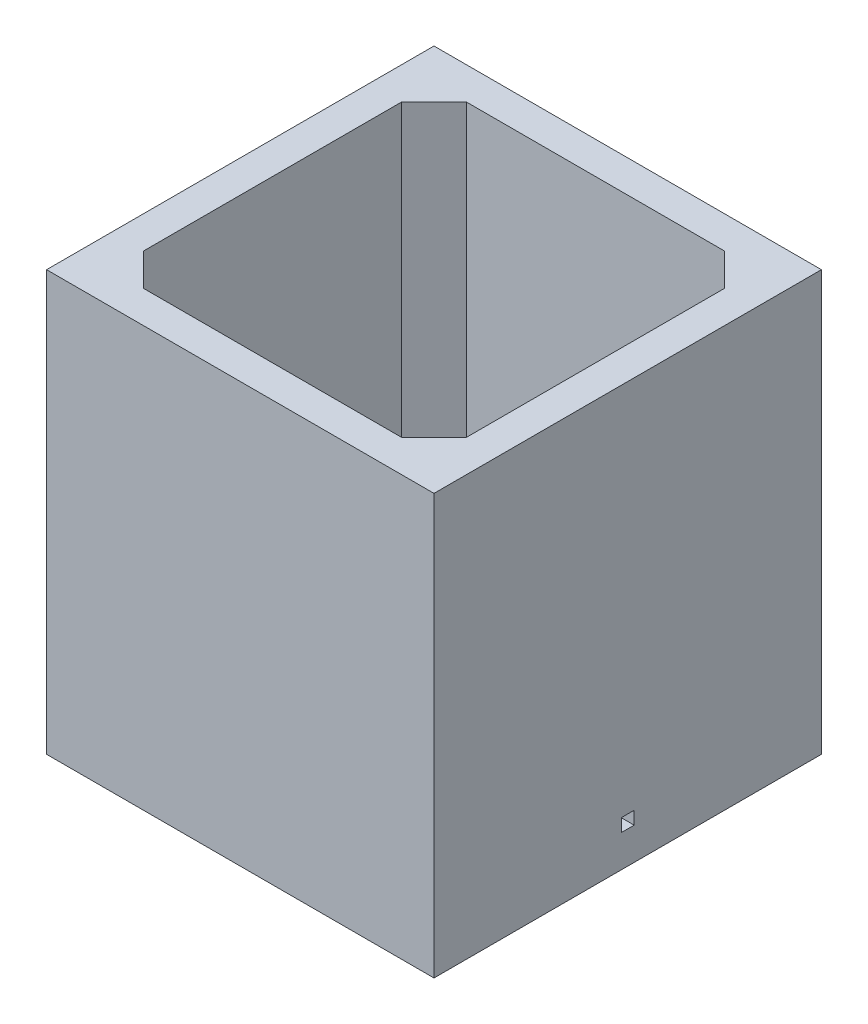
ISO-10303-21;
HEADER;
FILE_DESCRIPTION(('STEP AP214'),'2;1');
FILE_NAME('part.step','',(''),(''),'','','');
FILE_SCHEMA(('AUTOMOTIVE_DESIGN { 1 0 10303 214 1 1 1 1 }'));
ENDSEC;
DATA;
#1=APPLICATION_CONTEXT('core data for automotive mechanical design processes');
#2=APPLICATION_PROTOCOL_DEFINITION('international standard','automotive_design',2000,#1);
#3=PRODUCT_CONTEXT('',#1,'mechanical');
#4=PRODUCT('Part','Part','',(#3));
#5=PRODUCT_RELATED_PRODUCT_CATEGORY('part','',(#4));
#6=PRODUCT_DEFINITION_FORMATION('','',#4);
#7=PRODUCT_DEFINITION_CONTEXT('part definition',#1,'design');
#8=PRODUCT_DEFINITION('design','',#6,#7);
#9=PRODUCT_DEFINITION_SHAPE('','',#8);
#10=(LENGTH_UNIT() NAMED_UNIT(*) SI_UNIT(.MILLI.,.METRE.));
#11=(NAMED_UNIT(*) PLANE_ANGLE_UNIT() SI_UNIT($,.RADIAN.));
#12=(NAMED_UNIT(*) SI_UNIT($,.STERADIAN.) SOLID_ANGLE_UNIT());
#13=UNCERTAINTY_MEASURE_WITH_UNIT(LENGTH_MEASURE(1.E-05),#10,'distance_accuracy_value','');
#14=(GEOMETRIC_REPRESENTATION_CONTEXT(3) GLOBAL_UNCERTAINTY_ASSIGNED_CONTEXT((#13)) GLOBAL_UNIT_ASSIGNED_CONTEXT((#10,
#11,#12)) REPRESENTATION_CONTEXT('',''));
#15=CARTESIAN_POINT('',(0.,0.,0.));
#16=DIRECTION('',(0.,0.,1.));
#17=DIRECTION('',(1.,0.,0.));
#18=AXIS2_PLACEMENT_3D('',#15,#16,#17);
#19=CARTESIAN_POINT('',(0.,60.,0.));
#20=DIRECTION('',(0.,-1.,0.));
#21=DIRECTION('',(0.,0.,-1.));
#22=AXIS2_PLACEMENT_3D('',#19,#20,#21);
#23=PLANE('',#22);
#24=DIRECTION('',(0.,0.,-1.));
#25=VECTOR('',#24,1.);
#26=CARTESIAN_POINT('',(30.,60.,30.));
#27=LINE('',#26,#25);
#28=CARTESIAN_POINT('',(30.,60.,30.));
#29=VERTEX_POINT('',#28);
#30=CARTESIAN_POINT('',(30.,60.,-30.));
#31=VERTEX_POINT('',#30);
#32=EDGE_CURVE('E188',#29,#31,#27,.T.);
#33=ORIENTED_EDGE('',*,*,#32,.T.);
#34=DIRECTION('',(-1.,0.,0.));
#35=VECTOR('',#34,1.);
#36=CARTESIAN_POINT('',(-30.,60.,-30.));
#37=LINE('',#36,#35);
#38=CARTESIAN_POINT('',(-30.,60.,-30.));
#39=VERTEX_POINT('',#38);
#40=EDGE_CURVE('E191',#31,#39,#37,.T.);
#41=ORIENTED_EDGE('',*,*,#40,.T.);
#42=DIRECTION('',(0.,0.,1.));
#43=VECTOR('',#42,1.);
#44=CARTESIAN_POINT('',(-30.,60.,30.));
#45=LINE('',#44,#43);
#46=CARTESIAN_POINT('',(-30.,60.,30.));
#47=VERTEX_POINT('',#46);
#48=EDGE_CURVE('E193',#39,#47,#45,.T.);
#49=ORIENTED_EDGE('',*,*,#48,.T.);
#50=DIRECTION('',(1.,0.,0.));
#51=VECTOR('',#50,1.);
#52=CARTESIAN_POINT('',(-30.,60.,30.));
#53=LINE('',#52,#51);
#54=EDGE_CURVE('E195',#47,#29,#53,.T.);
#55=ORIENTED_EDGE('',*,*,#54,.T.);
#56=EDGE_LOOP('',(#33,#41,#49,#55));
#57=FACE_BOUND('',#56,.T.);
#58=DIRECTION('',(0.,0.,-1.));
#59=VECTOR('',#58,1.);
#60=CARTESIAN_POINT('',(25.,60.,25.));
#61=LINE('',#60,#59);
#62=CARTESIAN_POINT('',(25.,60.,20.));
#63=VERTEX_POINT('',#62);
#64=CARTESIAN_POINT('',(25.,60.,-20.));
#65=VERTEX_POINT('',#64);
#66=EDGE_CURVE('E187',#63,#65,#61,.T.);
#67=ORIENTED_EDGE('',*,*,#66,.F.);
#68=DIRECTION('',(0.707106781186551,0.,-0.707106781186544));
#69=VECTOR('',#68,1.);
#70=CARTESIAN_POINT('',(22.4999999999999,60.,22.5000000000001));
#71=LINE('',#70,#69);
#72=CARTESIAN_POINT('',(20.,60.,25.));
#73=VERTEX_POINT('',#72);
#74=EDGE_CURVE('E232',#63,#73,#71,.F.);
#75=ORIENTED_EDGE('',*,*,#74,.T.);
#76=DIRECTION('',(1.,0.,0.));
#77=VECTOR('',#76,1.);
#78=CARTESIAN_POINT('',(-25.,60.,25.));
#79=LINE('',#78,#77);
#80=CARTESIAN_POINT('',(-20.,60.,25.));
#81=VERTEX_POINT('',#80);
#82=EDGE_CURVE('E180',#81,#73,#79,.T.);
#83=ORIENTED_EDGE('',*,*,#82,.F.);
#84=DIRECTION('',(0.707106781186544,0.,0.707106781186551));
#85=VECTOR('',#84,1.);
#86=CARTESIAN_POINT('',(-22.5000000000001,60.,22.4999999999999));
#87=LINE('',#86,#85);
#88=CARTESIAN_POINT('',(-25.,60.,20.));
#89=VERTEX_POINT('',#88);
#90=EDGE_CURVE('E11',#81,#89,#87,.F.);
#91=ORIENTED_EDGE('',*,*,#90,.T.);
#92=DIRECTION('',(0.,0.,1.));
#93=VECTOR('',#92,1.);
#94=CARTESIAN_POINT('',(-25.,60.,25.));
#95=LINE('',#94,#93);
#96=CARTESIAN_POINT('',(-25.,60.,-20.));
#97=VERTEX_POINT('',#96);
#98=EDGE_CURVE('E244',#97,#89,#95,.T.);
#99=ORIENTED_EDGE('',*,*,#98,.F.);
#100=DIRECTION('',(-0.707106781186551,0.,0.707106781186544));
#101=VECTOR('',#100,1.);
#102=CARTESIAN_POINT('',(-22.4999999999999,60.,-22.5000000000001));
#103=LINE('',#102,#101);
#104=CARTESIAN_POINT('',(-20.,60.,-25.));
#105=VERTEX_POINT('',#104);
#106=EDGE_CURVE('E46',#97,#105,#103,.F.);
#107=ORIENTED_EDGE('',*,*,#106,.T.);
#108=DIRECTION('',(-1.,0.,0.));
#109=VECTOR('',#108,1.);
#110=CARTESIAN_POINT('',(-25.,60.,-25.));
#111=LINE('',#110,#109);
#112=CARTESIAN_POINT('',(20.,60.,-25.));
#113=VERTEX_POINT('',#112);
#114=EDGE_CURVE('E241',#113,#105,#111,.T.);
#115=ORIENTED_EDGE('',*,*,#114,.F.);
#116=DIRECTION('',(-0.707106781186545,0.,-0.70710678118655));
#117=VECTOR('',#116,1.);
#118=CARTESIAN_POINT('',(22.5000000000001,60.,-22.4999999999999));
#119=LINE('',#118,#117);
#120=EDGE_CURVE('E234',#113,#65,#119,.F.);
#121=ORIENTED_EDGE('',*,*,#120,.T.);
#122=EDGE_LOOP('',(#67,#75,#83,#91,#99,#107,#115,#121));
#123=FACE_BOUND('',#122,.T.);
#124=ADVANCED_FACE('F37',(#57,#123),#23,.F.);
#125=CARTESIAN_POINT('',(30.,60.,30.));
#126=DIRECTION('',(-1.,0.,0.));
#127=DIRECTION('',(0.,0.,1.));
#128=AXIS2_PLACEMENT_3D('',#125,#126,#127);
#129=PLANE('',#128);
#130=DIRECTION('',(0.,0.,1.));
#131=VECTOR('',#130,1.);
#132=CARTESIAN_POINT('',(30.,2.,-1.));
#133=LINE('',#132,#131);
#134=CARTESIAN_POINT('',(30.,2.,-1.));
#135=VERTEX_POINT('',#134);
#136=CARTESIAN_POINT('',(30.,2.,1.));
#137=VERTEX_POINT('',#136);
#138=EDGE_CURVE('E301',#135,#137,#133,.T.);
#139=ORIENTED_EDGE('',*,*,#138,.F.);
#140=DIRECTION('',(0.,1.,0.));
#141=VECTOR('',#140,1.);
#142=CARTESIAN_POINT('',(30.,0.,-1.));
#143=LINE('',#142,#141);
#144=CARTESIAN_POINT('',(30.,0.,-1.));
#145=VERTEX_POINT('',#144);
#146=EDGE_CURVE('E293',#145,#135,#143,.T.);
#147=ORIENTED_EDGE('',*,*,#146,.F.);
#148=DIRECTION('',(0.,0.,-1.));
#149=VECTOR('',#148,1.);
#150=CARTESIAN_POINT('',(30.,0.,-1.));
#151=LINE('',#150,#149);
#152=CARTESIAN_POINT('',(30.,0.,0.999999999999997));
#153=VERTEX_POINT('',#152);
#154=EDGE_CURVE('E289',#153,#145,#151,.T.);
#155=ORIENTED_EDGE('',*,*,#154,.F.);
#156=DIRECTION('',(0.,-1.,0.));
#157=VECTOR('',#156,1.);
#158=CARTESIAN_POINT('',(30.,0.,1.));
#159=LINE('',#158,#157);
#160=EDGE_CURVE('E156',#137,#153,#159,.T.);
#161=ORIENTED_EDGE('',*,*,#160,.F.);
#162=EDGE_LOOP('',(#139,#147,#155,#161));
#163=FACE_BOUND('',#162,.T.);
#164=DIRECTION('',(0.,-1.,0.));
#165=VECTOR('',#164,1.);
#166=CARTESIAN_POINT('',(30.,60.,30.));
#167=LINE('',#166,#165);
#168=CARTESIAN_POINT('',(30.,-5.,30.));
#169=VERTEX_POINT('',#168);
#170=EDGE_CURVE('E197',#29,#169,#167,.T.);
#171=ORIENTED_EDGE('',*,*,#170,.T.);
#172=DIRECTION('',(0.,0.,1.));
#173=VECTOR('',#172,1.);
#174=CARTESIAN_POINT('',(30.,-5.,-30.));
#175=LINE('',#174,#173);
#176=CARTESIAN_POINT('',(30.,-5.,-30.));
#177=VERTEX_POINT('',#176);
#178=EDGE_CURVE('E282',#177,#169,#175,.T.);
#179=ORIENTED_EDGE('',*,*,#178,.F.);
#180=DIRECTION('',(0.,-1.,0.));
#181=VECTOR('',#180,1.);
#182=CARTESIAN_POINT('',(30.,60.,-30.));
#183=LINE('',#182,#181);
#184=EDGE_CURVE('E203',#31,#177,#183,.T.);
#185=ORIENTED_EDGE('',*,*,#184,.F.);
#186=ORIENTED_EDGE('',*,*,#32,.F.);
#187=EDGE_LOOP('',(#171,#179,#185,#186));
#188=FACE_BOUND('',#187,.T.);
#189=ADVANCED_FACE('F309',(#163,#188),#129,.F.);
#190=CARTESIAN_POINT('',(-30.,60.,-30.));
#191=DIRECTION('',(0.,0.,1.));
#192=DIRECTION('',(1.,0.,0.));
#193=AXIS2_PLACEMENT_3D('',#190,#191,#192);
#194=PLANE('',#193);
#195=ORIENTED_EDGE('',*,*,#184,.T.);
#196=DIRECTION('',(1.,0.,0.));
#197=VECTOR('',#196,1.);
#198=CARTESIAN_POINT('',(-30.,-5.,-30.));
#199=LINE('',#198,#197);
#200=CARTESIAN_POINT('',(-30.,-5.,-30.));
#201=VERTEX_POINT('',#200);
#202=EDGE_CURVE('E178',#201,#177,#199,.T.);
#203=ORIENTED_EDGE('',*,*,#202,.F.);
#204=DIRECTION('',(0.,-1.,0.));
#205=VECTOR('',#204,1.);
#206=CARTESIAN_POINT('',(-30.,60.,-30.));
#207=LINE('',#206,#205);
#208=EDGE_CURVE('E201',#39,#201,#207,.T.);
#209=ORIENTED_EDGE('',*,*,#208,.F.);
#210=ORIENTED_EDGE('',*,*,#40,.F.);
#211=EDGE_LOOP('',(#195,#203,#209,#210));
#212=FACE_BOUND('',#211,.T.);
#213=ADVANCED_FACE('F331',(#212),#194,.F.);
#214=CARTESIAN_POINT('',(-30.,60.,30.));
#215=DIRECTION('',(1.,0.,0.));
#216=DIRECTION('',(0.,0.,-1.));
#217=AXIS2_PLACEMENT_3D('',#214,#215,#216);
#218=PLANE('',#217);
#219=ORIENTED_EDGE('',*,*,#208,.T.);
#220=DIRECTION('',(0.,0.,-1.));
#221=VECTOR('',#220,1.);
#222=CARTESIAN_POINT('',(-30.,-5.,-30.));
#223=LINE('',#222,#221);
#224=CARTESIAN_POINT('',(-30.,-5.,30.));
#225=VERTEX_POINT('',#224);
#226=EDGE_CURVE('E276',#225,#201,#223,.T.);
#227=ORIENTED_EDGE('',*,*,#226,.F.);
#228=DIRECTION('',(0.,-1.,0.));
#229=VECTOR('',#228,1.);
#230=CARTESIAN_POINT('',(-30.,60.,30.));
#231=LINE('',#230,#229);
#232=EDGE_CURVE('E199',#47,#225,#231,.T.);
#233=ORIENTED_EDGE('',*,*,#232,.F.);
#234=ORIENTED_EDGE('',*,*,#48,.F.);
#235=EDGE_LOOP('',(#219,#227,#233,#234));
#236=FACE_BOUND('',#235,.T.);
#237=ADVANCED_FACE('F339',(#236),#218,.F.);
#238=CARTESIAN_POINT('',(-30.,60.,30.));
#239=DIRECTION('',(0.,0.,-1.));
#240=DIRECTION('',(-1.,0.,0.));
#241=AXIS2_PLACEMENT_3D('',#238,#239,#240);
#242=PLANE('',#241);
#243=ORIENTED_EDGE('',*,*,#232,.T.);
#244=DIRECTION('',(-1.,0.,0.));
#245=VECTOR('',#244,1.);
#246=CARTESIAN_POINT('',(-30.,-5.,30.));
#247=LINE('',#246,#245);
#248=EDGE_CURVE('E279',#169,#225,#247,.T.);
#249=ORIENTED_EDGE('',*,*,#248,.F.);
#250=ORIENTED_EDGE('',*,*,#170,.F.);
#251=ORIENTED_EDGE('',*,*,#54,.F.);
#252=EDGE_LOOP('',(#243,#249,#250,#251));
#253=FACE_BOUND('',#252,.T.);
#254=ADVANCED_FACE('F336',(#253),#242,.F.);
#255=CARTESIAN_POINT('',(25.,60.,25.));
#256=DIRECTION('',(-1.,0.,0.));
#257=DIRECTION('',(0.,0.,1.));
#258=AXIS2_PLACEMENT_3D('',#255,#256,#257);
#259=PLANE('',#258);
#260=DIRECTION('',(0.,-1.,0.));
#261=VECTOR('',#260,1.);
#262=CARTESIAN_POINT('',(25.,0.,-1.));
#263=LINE('',#262,#261);
#264=CARTESIAN_POINT('',(25.,2.,-1.));
#265=VERTEX_POINT('',#264);
#266=CARTESIAN_POINT('',(25.,0.,-1.));
#267=VERTEX_POINT('',#266);
#268=EDGE_CURVE('E61',#265,#267,#263,.T.);
#269=ORIENTED_EDGE('',*,*,#268,.F.);
#270=DIRECTION('',(0.,0.,-1.));
#271=VECTOR('',#270,1.);
#272=CARTESIAN_POINT('',(25.,2.,-1.));
#273=LINE('',#272,#271);
#274=CARTESIAN_POINT('',(25.,2.,1.));
#275=VERTEX_POINT('',#274);
#276=EDGE_CURVE('E167',#275,#265,#273,.T.);
#277=ORIENTED_EDGE('',*,*,#276,.F.);
#278=DIRECTION('',(0.,1.,0.));
#279=VECTOR('',#278,1.);
#280=CARTESIAN_POINT('',(25.,0.,1.));
#281=LINE('',#280,#279);
#282=CARTESIAN_POINT('',(25.,0.,1.));
#283=VERTEX_POINT('',#282);
#284=EDGE_CURVE('E153',#283,#275,#281,.T.);
#285=ORIENTED_EDGE('',*,*,#284,.F.);
#286=DIRECTION('',(0.,0.,-1.));
#287=VECTOR('',#286,1.);
#288=CARTESIAN_POINT('',(25.,0.,25.));
#289=LINE('',#288,#287);
#290=CARTESIAN_POINT('',(25.,0.,20.));
#291=VERTEX_POINT('',#290);
#292=EDGE_CURVE('E164',#291,#283,#289,.T.);
#293=ORIENTED_EDGE('',*,*,#292,.F.);
#294=DIRECTION('',(0.,1.,0.));
#295=VECTOR('',#294,1.);
#296=CARTESIAN_POINT('',(25.,60.,20.));
#297=LINE('',#296,#295);
#298=EDGE_CURVE('E220',#291,#63,#297,.T.);
#299=ORIENTED_EDGE('',*,*,#298,.T.);
#300=ORIENTED_EDGE('',*,*,#66,.T.);
#301=DIRECTION('',(0.,-1.,0.));
#302=VECTOR('',#301,1.);
#303=CARTESIAN_POINT('',(25.,0.,-20.));
#304=LINE('',#303,#302);
#305=CARTESIAN_POINT('',(25.,0.,-20.));
#306=VERTEX_POINT('',#305);
#307=EDGE_CURVE('E217',#65,#306,#304,.T.);
#308=ORIENTED_EDGE('',*,*,#307,.T.);
#309=EDGE_CURVE('E173',#267,#306,#289,.T.);
#310=ORIENTED_EDGE('',*,*,#309,.F.);
#311=EDGE_LOOP('',(#269,#277,#285,#293,#299,#300,#308,#310));
#312=FACE_BOUND('',#311,.T.);
#313=ADVANCED_FACE('F163',(#312),#259,.T.);
#314=CARTESIAN_POINT('',(-25.,60.,-25.));
#315=DIRECTION('',(0.,0.,1.));
#316=DIRECTION('',(1.,0.,0.));
#317=AXIS2_PLACEMENT_3D('',#314,#315,#316);
#318=PLANE('',#317);
#319=DIRECTION('',(-1.,0.,0.));
#320=VECTOR('',#319,1.);
#321=CARTESIAN_POINT('',(-25.,0.,-25.));
#322=LINE('',#321,#320);
#323=CARTESIAN_POINT('',(20.,0.,-25.));
#324=VERTEX_POINT('',#323);
#325=CARTESIAN_POINT('',(-20.,0.,-25.));
#326=VERTEX_POINT('',#325);
#327=EDGE_CURVE('E172',#324,#326,#322,.T.);
#328=ORIENTED_EDGE('',*,*,#327,.F.);
#329=DIRECTION('',(0.,1.,0.));
#330=VECTOR('',#329,1.);
#331=CARTESIAN_POINT('',(20.,60.,-25.));
#332=LINE('',#331,#330);
#333=EDGE_CURVE('E225',#324,#113,#332,.T.);
#334=ORIENTED_EDGE('',*,*,#333,.T.);
#335=ORIENTED_EDGE('',*,*,#114,.T.);
#336=DIRECTION('',(0.,-1.,0.));
#337=VECTOR('',#336,1.);
#338=CARTESIAN_POINT('',(-20.,0.,-25.));
#339=LINE('',#338,#337);
#340=EDGE_CURVE('E222',#105,#326,#339,.T.);
#341=ORIENTED_EDGE('',*,*,#340,.T.);
#342=EDGE_LOOP('',(#328,#334,#335,#341));
#343=FACE_BOUND('',#342,.T.);
#344=ADVANCED_FACE('F250',(#343),#318,.T.);
#345=CARTESIAN_POINT('',(-25.,60.,25.));
#346=DIRECTION('',(1.,0.,0.));
#347=DIRECTION('',(0.,0.,-1.));
#348=AXIS2_PLACEMENT_3D('',#345,#346,#347);
#349=PLANE('',#348);
#350=DIRECTION('',(0.,0.,1.));
#351=VECTOR('',#350,1.);
#352=CARTESIAN_POINT('',(-25.,0.,25.));
#353=LINE('',#352,#351);
#354=CARTESIAN_POINT('',(-25.,0.,-20.));
#355=VERTEX_POINT('',#354);
#356=CARTESIAN_POINT('',(-25.,0.,20.));
#357=VERTEX_POINT('',#356);
#358=EDGE_CURVE('E176',#355,#357,#353,.T.);
#359=ORIENTED_EDGE('',*,*,#358,.F.);
#360=DIRECTION('',(0.,1.,0.));
#361=VECTOR('',#360,1.);
#362=CARTESIAN_POINT('',(-25.,60.,-20.));
#363=LINE('',#362,#361);
#364=EDGE_CURVE('E230',#355,#97,#363,.T.);
#365=ORIENTED_EDGE('',*,*,#364,.T.);
#366=ORIENTED_EDGE('',*,*,#98,.T.);
#367=DIRECTION('',(0.,-1.,0.));
#368=VECTOR('',#367,1.);
#369=CARTESIAN_POINT('',(-25.,0.,20.));
#370=LINE('',#369,#368);
#371=EDGE_CURVE('E227',#89,#357,#370,.T.);
#372=ORIENTED_EDGE('',*,*,#371,.T.);
#373=EDGE_LOOP('',(#359,#365,#366,#372));
#374=FACE_BOUND('',#373,.T.);
#375=ADVANCED_FACE('F256',(#374),#349,.T.);
#376=CARTESIAN_POINT('',(-25.,60.,25.));
#377=DIRECTION('',(0.,0.,-1.));
#378=DIRECTION('',(-1.,0.,0.));
#379=AXIS2_PLACEMENT_3D('',#376,#377,#378);
#380=PLANE('',#379);
#381=ORIENTED_EDGE('',*,*,#82,.T.);
#382=DIRECTION('',(0.,-1.,0.));
#383=VECTOR('',#382,1.);
#384=CARTESIAN_POINT('',(20.,0.,25.));
#385=LINE('',#384,#383);
#386=CARTESIAN_POINT('',(20.,0.,25.));
#387=VERTEX_POINT('',#386);
#388=EDGE_CURVE('E207',#73,#387,#385,.T.);
#389=ORIENTED_EDGE('',*,*,#388,.T.);
#390=DIRECTION('',(1.,0.,0.));
#391=VECTOR('',#390,1.);
#392=CARTESIAN_POINT('',(-25.,0.,25.));
#393=LINE('',#392,#391);
#394=CARTESIAN_POINT('',(-20.,0.,25.));
#395=VERTEX_POINT('',#394);
#396=EDGE_CURVE('E185',#395,#387,#393,.T.);
#397=ORIENTED_EDGE('',*,*,#396,.F.);
#398=DIRECTION('',(0.,1.,0.));
#399=VECTOR('',#398,1.);
#400=CARTESIAN_POINT('',(-20.,60.,25.));
#401=LINE('',#400,#399);
#402=EDGE_CURVE('E205',#395,#81,#401,.T.);
#403=ORIENTED_EDGE('',*,*,#402,.T.);
#404=EDGE_LOOP('',(#381,#389,#397,#403));
#405=FACE_BOUND('',#404,.T.);
#406=ADVANCED_FACE('F264',(#405),#380,.T.);
#407=CARTESIAN_POINT('',(0.,0.,0.));
#408=DIRECTION('',(0.,1.,0.));
#409=DIRECTION('',(0.,0.,1.));
#410=AXIS2_PLACEMENT_3D('',#407,#408,#409);
#411=PLANE('',#410);
#412=CARTESIAN_POINT('',(0.,0.,0.));
#413=DIRECTION('',(0.,1.,0.));
#414=DIRECTION('',(0.,0.,1.));
#415=AXIS2_PLACEMENT_3D('',#412,#413,#414);
#416=CIRCLE('',#415,10.);
#417=CARTESIAN_POINT('',(0.,0.,10.));
#418=VERTEX_POINT('',#417);
#419=EDGE_CURVE('E286',#418,#418,#416,.T.);
#420=ORIENTED_EDGE('',*,*,#419,.F.);
#421=EDGE_LOOP('',(#420));
#422=FACE_BOUND('',#421,.T.);
#423=ORIENTED_EDGE('',*,*,#396,.T.);
#424=DIRECTION('',(-0.707106781186551,0.,0.707106781186544));
#425=VECTOR('',#424,1.);
#426=CARTESIAN_POINT('',(22.4999999999999,0.,22.5000000000001));
#427=LINE('',#426,#425);
#428=EDGE_CURVE('E171',#387,#291,#427,.F.);
#429=ORIENTED_EDGE('',*,*,#428,.T.);
#430=ORIENTED_EDGE('',*,*,#292,.T.);
#431=DIRECTION('',(-1.,0.,0.));
#432=VECTOR('',#431,1.);
#433=CARTESIAN_POINT('',(32.8284271247462,0.,1.));
#434=LINE('',#433,#432);
#435=EDGE_CURVE('E53',#153,#283,#434,.T.);
#436=ORIENTED_EDGE('',*,*,#435,.F.);
#437=ORIENTED_EDGE('',*,*,#154,.T.);
#438=DIRECTION('',(-1.,0.,0.));
#439=VECTOR('',#438,1.);
#440=CARTESIAN_POINT('',(32.8284271247462,0.,-1.));
#441=LINE('',#440,#439);
#442=EDGE_CURVE('E159',#145,#267,#441,.T.);
#443=ORIENTED_EDGE('',*,*,#442,.T.);
#444=ORIENTED_EDGE('',*,*,#309,.T.);
#445=DIRECTION('',(0.707106781186545,0.,0.70710678118655));
#446=VECTOR('',#445,1.);
#447=CARTESIAN_POINT('',(22.5000000000001,0.,-22.4999999999999));
#448=LINE('',#447,#446);
#449=EDGE_CURVE('E214',#306,#324,#448,.F.);
#450=ORIENTED_EDGE('',*,*,#449,.T.);
#451=ORIENTED_EDGE('',*,*,#327,.T.);
#452=DIRECTION('',(0.707106781186551,0.,-0.707106781186544));
#453=VECTOR('',#452,1.);
#454=CARTESIAN_POINT('',(-22.4999999999999,0.,-22.5000000000001));
#455=LINE('',#454,#453);
#456=EDGE_CURVE('E212',#326,#355,#455,.F.);
#457=ORIENTED_EDGE('',*,*,#456,.T.);
#458=ORIENTED_EDGE('',*,*,#358,.T.);
#459=DIRECTION('',(-0.707106781186544,0.,-0.707106781186551));
#460=VECTOR('',#459,1.);
#461=CARTESIAN_POINT('',(-22.5000000000001,0.,22.4999999999999));
#462=LINE('',#461,#460);
#463=EDGE_CURVE('E210',#357,#395,#462,.F.);
#464=ORIENTED_EDGE('',*,*,#463,.T.);
#465=EDGE_LOOP('',(#423,#429,#430,#436,#437,#443,#444,#450,#451,#457,#458,#464));
#466=FACE_BOUND('',#465,.T.);
#467=ADVANCED_FACE('F170',(#422,#466),#411,.T.);
#468=CARTESIAN_POINT('',(0.,-5.,0.));
#469=DIRECTION('',(0.,1.,0.));
#470=DIRECTION('',(0.,0.,1.));
#471=AXIS2_PLACEMENT_3D('',#468,#469,#470);
#472=PLANE('',#471);
#473=CARTESIAN_POINT('',(0.,-5.,0.));
#474=DIRECTION('',(0.,1.,0.));
#475=DIRECTION('',(0.,0.,1.));
#476=AXIS2_PLACEMENT_3D('',#473,#474,#475);
#477=CIRCLE('',#476,10.);
#478=CARTESIAN_POINT('',(0.,-5.,10.));
#479=VERTEX_POINT('',#478);
#480=EDGE_CURVE('E285',#479,#479,#477,.T.);
#481=ORIENTED_EDGE('',*,*,#480,.T.);
#482=EDGE_LOOP('',(#481));
#483=FACE_BOUND('',#482,.T.);
#484=ORIENTED_EDGE('',*,*,#178,.T.);
#485=ORIENTED_EDGE('',*,*,#248,.T.);
#486=ORIENTED_EDGE('',*,*,#226,.T.);
#487=ORIENTED_EDGE('',*,*,#202,.T.);
#488=EDGE_LOOP('',(#484,#485,#486,#487));
#489=FACE_BOUND('',#488,.T.);
#490=ADVANCED_FACE('F364',(#483,#489),#472,.F.);
#491=CARTESIAN_POINT('',(0.,-5.,0.));
#492=DIRECTION('',(0.,1.,0.));
#493=DIRECTION('',(0.,0.,1.));
#494=AXIS2_PLACEMENT_3D('',#491,#492,#493);
#495=CYLINDRICAL_SURFACE('',#494,10.);
#496=ORIENTED_EDGE('',*,*,#480,.F.);
#497=EDGE_LOOP('',(#496));
#498=FACE_BOUND('',#497,.T.);
#499=ORIENTED_EDGE('',*,*,#419,.T.);
#500=EDGE_LOOP('',(#499));
#501=FACE_BOUND('',#500,.T.);
#502=ADVANCED_FACE('F322',(#498,#501),#495,.F.);
#503=CARTESIAN_POINT('',(20.,60.,25.));
#504=DIRECTION('',(-0.707106781186543,0.,-0.707106781186551));
#505=DIRECTION('',(0.,1.,0.));
#506=AXIS2_PLACEMENT_3D('',#503,#504,#505);
#507=PLANE('',#506);
#508=ORIENTED_EDGE('',*,*,#74,.F.);
#509=ORIENTED_EDGE('',*,*,#298,.F.);
#510=ORIENTED_EDGE('',*,*,#428,.F.);
#511=ORIENTED_EDGE('',*,*,#388,.F.);
#512=EDGE_LOOP('',(#508,#509,#510,#511));
#513=FACE_BOUND('',#512,.T.);
#514=ADVANCED_FACE('F269',(#513),#507,.T.);
#515=CARTESIAN_POINT('',(25.,60.,-20.));
#516=DIRECTION('',(-0.707106781186551,0.,0.707106781186545));
#517=DIRECTION('',(0.,1.,0.));
#518=AXIS2_PLACEMENT_3D('',#515,#516,#517);
#519=PLANE('',#518);
#520=ORIENTED_EDGE('',*,*,#120,.F.);
#521=ORIENTED_EDGE('',*,*,#333,.F.);
#522=ORIENTED_EDGE('',*,*,#449,.F.);
#523=ORIENTED_EDGE('',*,*,#307,.F.);
#524=EDGE_LOOP('',(#520,#521,#522,#523));
#525=FACE_BOUND('',#524,.T.);
#526=ADVANCED_FACE('F315',(#525),#519,.T.);
#527=CARTESIAN_POINT('',(-20.,60.,-25.));
#528=DIRECTION('',(0.707106781186543,0.,0.707106781186551));
#529=DIRECTION('',(0.,1.,0.));
#530=AXIS2_PLACEMENT_3D('',#527,#528,#529);
#531=PLANE('',#530);
#532=ORIENTED_EDGE('',*,*,#106,.F.);
#533=ORIENTED_EDGE('',*,*,#364,.F.);
#534=ORIENTED_EDGE('',*,*,#456,.F.);
#535=ORIENTED_EDGE('',*,*,#340,.F.);
#536=EDGE_LOOP('',(#532,#533,#534,#535));
#537=FACE_BOUND('',#536,.T.);
#538=ADVANCED_FACE('F253',(#537),#531,.T.);
#539=CARTESIAN_POINT('',(-25.,60.,20.));
#540=DIRECTION('',(0.707106781186551,0.,-0.707106781186543));
#541=DIRECTION('',(0.,1.,0.));
#542=AXIS2_PLACEMENT_3D('',#539,#540,#541);
#543=PLANE('',#542);
#544=ORIENTED_EDGE('',*,*,#90,.F.);
#545=ORIENTED_EDGE('',*,*,#402,.F.);
#546=ORIENTED_EDGE('',*,*,#463,.F.);
#547=ORIENTED_EDGE('',*,*,#371,.F.);
#548=EDGE_LOOP('',(#544,#545,#546,#547));
#549=FACE_BOUND('',#548,.T.);
#550=ADVANCED_FACE('F40',(#549),#543,.T.);
#551=CARTESIAN_POINT('',(32.8284271247462,0.,-1.));
#552=DIRECTION('',(0.,0.,-1.));
#553=DIRECTION('',(-1.,0.,0.));
#554=AXIS2_PLACEMENT_3D('',#551,#552,#553);
#555=PLANE('',#554);
#556=ORIENTED_EDGE('',*,*,#146,.T.);
#557=DIRECTION('',(-1.,0.,0.));
#558=VECTOR('',#557,1.);
#559=CARTESIAN_POINT('',(32.8284271247462,2.,-1.));
#560=LINE('',#559,#558);
#561=EDGE_CURVE('E296',#135,#265,#560,.T.);
#562=ORIENTED_EDGE('',*,*,#561,.T.);
#563=ORIENTED_EDGE('',*,*,#268,.T.);
#564=ORIENTED_EDGE('',*,*,#442,.F.);
#565=EDGE_LOOP('',(#556,#562,#563,#564));
#566=FACE_BOUND('',#565,.T.);
#567=ADVANCED_FACE('F312',(#566),#555,.F.);
#568=CARTESIAN_POINT('',(32.8284271247462,2.,-1.));
#569=DIRECTION('',(0.,1.,0.));
#570=DIRECTION('',(0.,0.,1.));
#571=AXIS2_PLACEMENT_3D('',#568,#569,#570);
#572=PLANE('',#571);
#573=ORIENTED_EDGE('',*,*,#138,.T.);
#574=DIRECTION('',(-1.,0.,0.));
#575=VECTOR('',#574,1.);
#576=CARTESIAN_POINT('',(32.8284271247462,2.,1.));
#577=LINE('',#576,#575);
#578=EDGE_CURVE('E158',#137,#275,#577,.T.);
#579=ORIENTED_EDGE('',*,*,#578,.T.);
#580=ORIENTED_EDGE('',*,*,#276,.T.);
#581=ORIENTED_EDGE('',*,*,#561,.F.);
#582=EDGE_LOOP('',(#573,#579,#580,#581));
#583=FACE_BOUND('',#582,.T.);
#584=ADVANCED_FACE('F306',(#583),#572,.F.);
#585=CARTESIAN_POINT('',(32.8284271247462,0.,1.));
#586=DIRECTION('',(0.,0.,1.));
#587=DIRECTION('',(1.,0.,0.));
#588=AXIS2_PLACEMENT_3D('',#585,#586,#587);
#589=PLANE('',#588);
#590=ORIENTED_EDGE('',*,*,#160,.T.);
#591=ORIENTED_EDGE('',*,*,#435,.T.);
#592=ORIENTED_EDGE('',*,*,#284,.T.);
#593=ORIENTED_EDGE('',*,*,#578,.F.);
#594=EDGE_LOOP('',(#590,#591,#592,#593));
#595=FACE_BOUND('',#594,.T.);
#596=ADVANCED_FACE('F151',(#595),#589,.F.);
#597=CLOSED_SHELL('',(#124,#189,#213,#237,#254,#313,#344,#375,#406,#467,#490,#502,#514,#526,
#538,#550,#567,#584,#596));
#598=MANIFOLD_SOLID_BREP('B2',#597);
#599=ADVANCED_BREP_SHAPE_REPRESENTATION('',(#18,#598),#14);
#600=SHAPE_DEFINITION_REPRESENTATION(#9,#599);
ENDSEC;
END-ISO-10303-21;
